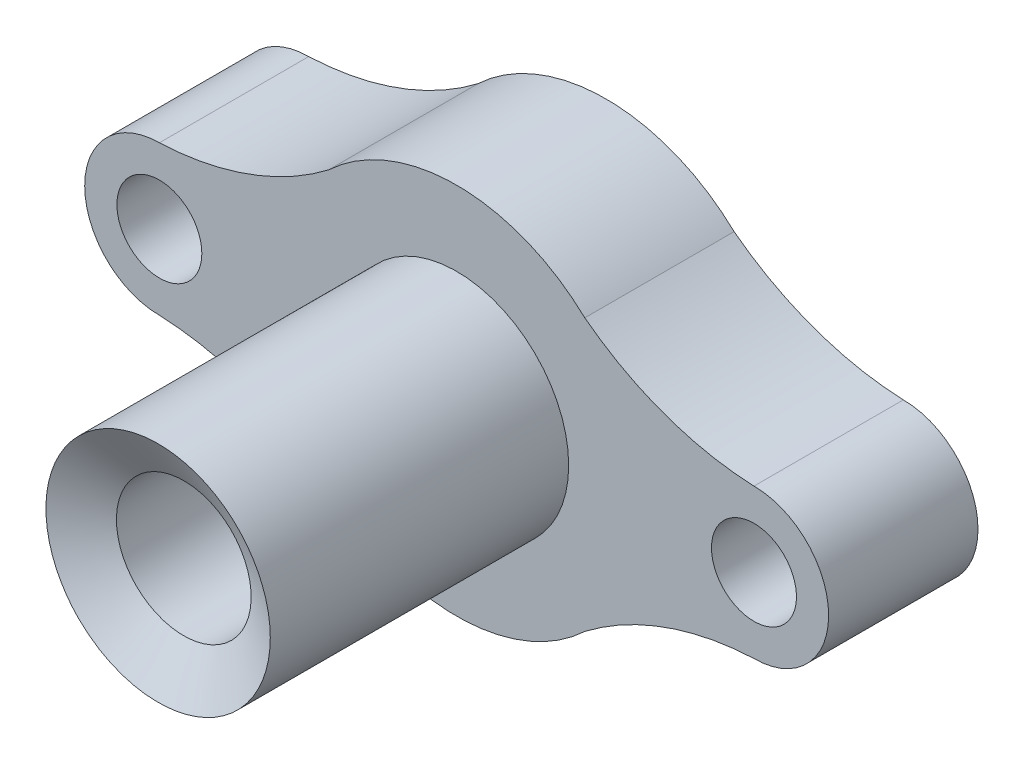
ISO-10303-21;
HEADER;
FILE_DESCRIPTION(('STEP AP214'),'2;1');
FILE_NAME('part.step','',(''),(''),'','','');
FILE_SCHEMA(('AUTOMOTIVE_DESIGN { 1 0 10303 214 1 1 1 1 }'));
ENDSEC;
DATA;
#1=APPLICATION_CONTEXT('core data for automotive mechanical design processes');
#2=APPLICATION_PROTOCOL_DEFINITION('international standard','automotive_design',2000,#1);
#3=PRODUCT_CONTEXT('',#1,'mechanical');
#4=PRODUCT('Part','Part','',(#3));
#5=PRODUCT_RELATED_PRODUCT_CATEGORY('part','',(#4));
#6=PRODUCT_DEFINITION_FORMATION('','',#4);
#7=PRODUCT_DEFINITION_CONTEXT('part definition',#1,'design');
#8=PRODUCT_DEFINITION('design','',#6,#7);
#9=PRODUCT_DEFINITION_SHAPE('','',#8);
#10=(LENGTH_UNIT() NAMED_UNIT(*) SI_UNIT(.MILLI.,.METRE.));
#11=(NAMED_UNIT(*) PLANE_ANGLE_UNIT() SI_UNIT($,.RADIAN.));
#12=(NAMED_UNIT(*) SI_UNIT($,.STERADIAN.) SOLID_ANGLE_UNIT());
#13=UNCERTAINTY_MEASURE_WITH_UNIT(LENGTH_MEASURE(1.E-05),#10,'distance_accuracy_value','');
#14=(GEOMETRIC_REPRESENTATION_CONTEXT(3) GLOBAL_UNCERTAINTY_ASSIGNED_CONTEXT((#13)) GLOBAL_UNIT_ASSIGNED_CONTEXT((#10,
#11,#12)) REPRESENTATION_CONTEXT('',''));
#15=CARTESIAN_POINT('',(0.,0.,0.));
#16=DIRECTION('',(0.,0.,1.));
#17=DIRECTION('',(1.,0.,0.));
#18=AXIS2_PLACEMENT_3D('',#15,#16,#17);
#19=CARTESIAN_POINT('',(0.,0.,300.));
#20=DIRECTION('',(0.,0.,-1.));
#21=DIRECTION('',(-1.,0.,0.));
#22=AXIS2_PLACEMENT_3D('',#19,#20,#21);
#23=CYLINDRICAL_SURFACE('',#22,75.);
#24=CARTESIAN_POINT('',(0.,0.,100.));
#25=DIRECTION('',(0.,0.,1.));
#26=DIRECTION('',(1.,0.,0.));
#27=AXIS2_PLACEMENT_3D('',#24,#25,#26);
#28=CIRCLE('',#27,75.);
#29=CARTESIAN_POINT('',(75.,0.,100.));
#30=VERTEX_POINT('',#29);
#31=EDGE_CURVE('E65',#30,#30,#28,.T.);
#32=ORIENTED_EDGE('',*,*,#31,.T.);
#33=EDGE_LOOP('',(#32));
#34=FACE_BOUND('',#33,.T.);
#35=CARTESIAN_POINT('',(-61.0252990826169,-43.5994595365259,299.980480852214));
#36=CARTESIAN_POINT('',(-60.4128809969187,-44.4566509724594,299.979625264154));
#37=CARTESIAN_POINT('',(-59.7824179628006,-45.3009090738324,299.978744440642));
#38=CARTESIAN_POINT('',(-58.486430905328,-46.9621896569286,299.976933751053));
#39=CARTESIAN_POINT('',(-57.820904437094,-47.7792102329495,299.976003881555));
#40=CARTESIAN_POINT('',(-56.4559004519219,-49.3846300802318,299.974096641425));
#41=CARTESIAN_POINT('',(-55.7564167768266,-50.1730241143996,299.973119262176));
#42=CARTESIAN_POINT('',(-54.324783375334,-51.7197105287908,299.971118788527));
#43=CARTESIAN_POINT('',(-53.5926306318297,-52.4780001164878,299.970095689905));
#44=CARTESIAN_POINT('',(-52.096261393096,-53.9638060674285,299.968004609539));
#45=CARTESIAN_POINT('',(-51.3320130957333,-54.6912904022687,299.966936583275));
#46=CARTESIAN_POINT('',(-49.7734359467015,-56.1134395235662,299.964758409332));
#47=CARTESIAN_POINT('',(-48.979104283293,-56.8081012285531,299.963648257715));
#48=CARTESIAN_POINT('',(-47.3619716584453,-58.1631868672869,299.96138807541));
#49=CARTESIAN_POINT('',(-46.5391752738868,-58.8236162630203,299.960238051133));
#50=CARTESIAN_POINT('',(-44.8663791886079,-60.1092413223152,299.957899883623));
#51=CARTESIAN_POINT('',(-44.0163769500819,-60.7344336838032,299.956711736833));
#52=CARTESIAN_POINT('',(-42.2912272042038,-61.9480730784921,299.954300191895));
#53=CARTESIAN_POINT('',(-41.4160936919506,-62.536540005389,299.953076813365));
#54=CARTESIAN_POINT('',(-39.6417114976382,-63.6761068167788,299.950596236192));
#55=CARTESIAN_POINT('',(-38.7424605676536,-64.2272032010447,299.949339034396));
#56=CARTESIAN_POINT('',(-36.921590695468,-65.2909474438006,299.946793244723));
#57=CARTESIAN_POINT('',(-35.9999734971726,-65.8035982872353,299.945504659292));
#58=CARTESIAN_POINT('',(-34.1358619912945,-66.789631480931,299.942898178746));
#59=CARTESIAN_POINT('',(-33.1933657393382,-67.2630101543059,299.941580280902));
#60=CARTESIAN_POINT('',(-31.2895639230087,-68.1694519159153,299.938918059187));
#61=CARTESIAN_POINT('',(-30.3282650272468,-68.6025289947849,299.937573744685));
#62=CARTESIAN_POINT('',(-28.3882464790829,-69.4277983851737,299.934860624428));
#63=CARTESIAN_POINT('',(-27.4095252064392,-69.8199868706448,299.933491816397));
#64=CARTESIAN_POINT('',(-24.4500114308128,-70.9340413617623,299.929352534709));
#65=CARTESIAN_POINT('',(-22.4453478631323,-71.5936444397238,299.926548474768));
#66=CARTESIAN_POINT('',(-18.387640750951,-72.7416147357459,299.920872112705));
#67=CARTESIAN_POINT('',(-16.3345920438454,-73.2299635922132,299.917999803301));
#68=CARTESIAN_POINT('',(-12.194578404043,-74.0320017401627,299.912207142931));
#69=CARTESIAN_POINT('',(-10.1076134369573,-74.3456908545395,299.909286791918));
#70=CARTESIAN_POINT('',(-5.91461428981311,-74.796148408288,299.903418801123));
#71=CARTESIAN_POINT('',(-3.80857937059909,-74.9329099600932,299.900471160284));
#72=CARTESIAN_POINT('',(0.407529995864249,-75.0285279602957,299.894569615282));
#73=CARTESIAN_POINT('',(2.51760444232348,-74.9873844434855,299.891615711119));
#74=CARTESIAN_POINT('',(6.7267468628134,-74.7274844538542,299.885722705064));
#75=CARTESIAN_POINT('',(8.82581503477657,-74.5087311861985,299.882783602905));
#76=CARTESIAN_POINT('',(12.9980619524689,-73.8951717046809,299.876941055414));
#77=CARTESIAN_POINT('',(15.0712406977096,-73.5003654874969,299.874037610083));
#78=CARTESIAN_POINT('',(19.1769649959032,-72.537507705617,299.868287052562));
#79=CARTESIAN_POINT('',(21.2095106310246,-71.9694564912959,299.865439940259));
#80=CARTESIAN_POINT('',(25.2195229914764,-70.6641469718456,299.859822323445));
#81=CARTESIAN_POINT('',(27.1969897168824,-69.9268886669491,299.857051818935));
#82=CARTESIAN_POINT('',(31.0827891747025,-68.2884048875197,299.851607159598));
#83=CARTESIAN_POINT('',(32.9911217811855,-67.3871791143303,299.848933004947));
#84=CARTESIAN_POINT('',(36.7250820650824,-65.42716845876,299.843700121675));
#85=CARTESIAN_POINT('',(38.5507097425149,-64.3683835764144,299.841141393054));
#86=CARTESIAN_POINT('',(42.1062777756162,-62.1007840673242,299.836157624252));
#87=CARTESIAN_POINT('',(43.8362183041195,-60.8919697115824,299.833732583831));
#88=CARTESIAN_POINT('',(47.1881167361123,-58.3329036600578,299.829033499414));
#89=CARTESIAN_POINT('',(48.8100746397929,-56.9826519645253,299.826759455418));
#90=CARTESIAN_POINT('',(51.9344761877357,-54.1503110957635,299.822378607487));
#91=CARTESIAN_POINT('',(53.4369198668857,-52.6682219610195,299.820271803502));
#92=CARTESIAN_POINT('',(56.3116119860033,-49.5827426121102,299.816240490222));
#93=CARTESIAN_POINT('',(57.6838604258435,-47.9793523978261,299.814315980926));
#94=CARTESIAN_POINT('',(60.2884075327527,-44.6626682661534,299.810663013616));
#95=CARTESIAN_POINT('',(61.5207060524658,-42.9493742330482,299.808934555809));
#96=CARTESIAN_POINT('',(63.8365906844307,-39.4250644892744,299.805686055521));
#97=CARTESIAN_POINT('',(64.9201767967022,-37.6140487786188,299.80416601304));
#98=CARTESIAN_POINT('',(66.9309316184703,-33.9071733144804,299.801345220074));
#99=CARTESIAN_POINT('',(67.8581005277589,-32.0113136693728,299.800044469309));
#100=CARTESIAN_POINT('',(69.549430970552,-28.1482266176067,299.797671566142));
#101=CARTESIAN_POINT('',(70.3135925042738,-26.1809992110433,299.796599413739));
#102=CARTESIAN_POINT('',(71.6734751492866,-22.1891632772435,299.794691382387));
#103=CARTESIAN_POINT('',(72.2691963294702,-20.1645547734763,299.793855503341));
#104=CARTESIAN_POINT('',(73.2879634336667,-16.0723496429975,299.792426002722));
#105=CARTESIAN_POINT('',(73.7110093577776,-14.0047530163101,299.791832381149));
#106=CARTESIAN_POINT('',(74.3814180962679,-9.84127245478861,299.790891646562));
#107=CARTESIAN_POINT('',(74.6287810304055,-7.74538853923818,299.79054453338));
#108=CARTESIAN_POINT('',(74.9460656440345,-3.54023250338786,299.790099300746));
#109=CARTESIAN_POINT('',(75.0159873235867,-1.43096038309257,299.790001181295));
#110=CARTESIAN_POINT('',(74.9778923211456,2.78597666401557,299.790054638833));
#111=CARTESIAN_POINT('',(74.8698756163088,4.89364159062206,299.790206215856));
#112=CARTESIAN_POINT('',(74.4766717410034,9.09237973247542,299.790757980851));
#113=CARTESIAN_POINT('',(74.1914845705386,11.1834529477227,299.791158168823));
#114=CARTESIAN_POINT('',(73.4459674246439,15.3341406152344,299.79220428965));
#115=CARTESIAN_POINT('',(72.9856375136854,17.3937550790788,299.792850222416));
#116=CARTESIAN_POINT('',(71.8931075663781,21.4668834131797,299.794383207629));
#117=CARTESIAN_POINT('',(71.2609075300985,23.4803972834547,299.795270260076));
#118=CARTESIAN_POINT('',(69.8291319499831,27.4470094786123,299.797279133877));
#119=CARTESIAN_POINT('',(69.0295564136628,29.4001078062077,299.79840095522));
#120=CARTESIAN_POINT('',(67.2687143431536,33.2320036758553,299.800871337016));
#121=CARTESIAN_POINT('',(66.3074478089104,35.1108012178826,299.802219897469));
#122=CARTESIAN_POINT('',(64.2300574708533,38.7807389970544,299.805134107666));
#123=CARTESIAN_POINT('',(63.1139336187105,40.571879206842,299.806699757479));
#124=CARTESIAN_POINT('',(60.7347638700989,44.0537677940844,299.810036945752));
#125=CARTESIAN_POINT('',(59.4717179736131,45.7445161715276,299.811808484211));
#126=CARTESIAN_POINT('',(56.8076835926576,49.0136010078991,299.815544781115));
#127=CARTESIAN_POINT('',(55.4066951016,50.5919374614589,299.817509539569));
#128=CARTESIAN_POINT('',(52.4767357843378,53.6249773857918,299.821618231393));
#129=CARTESIAN_POINT('',(50.9477649580437,55.0796808564786,299.823762164765));
#130=CARTESIAN_POINT('',(47.7727096837939,57.8551139876717,299.828213889138));
#131=CARTESIAN_POINT('',(46.1266251357751,59.175843533707,299.830521680279));
#132=CARTESIAN_POINT('',(42.7290462633567,61.6739378488405,299.835284636247));
#133=CARTESIAN_POINT('',(40.9775519389121,62.8513026178777,299.837739801073));
#134=CARTESIAN_POINT('',(37.3816058194569,65.0542969288155,299.842779978001));
#135=CARTESIAN_POINT('',(35.5371540362321,66.0799264899542,299.845364990087));
#136=CARTESIAN_POINT('',(31.7684057290993,67.9721590017509,299.850646418603));
#137=CARTESIAN_POINT('',(29.8441092051631,68.8387619523524,299.853342835033));
#138=CARTESIAN_POINT('',(25.9293503894084,70.4067809021774,299.858827847091));
#139=CARTESIAN_POINT('',(23.9388880436095,71.1081967666318,299.861616442796));
#140=CARTESIAN_POINT('',(19.9059500571794,72.34085402115,299.867265938042));
#141=CARTESIAN_POINT('',(17.8634744165093,72.8720954110867,299.870126837584));
#142=CARTESIAN_POINT('',(13.741029755975,73.7606271170428,299.875900565211));
#143=CARTESIAN_POINT('',(11.6610607207904,74.1179173619809,299.878813393317));
#144=CARTESIAN_POINT('',(7.4784174021407,74.6560063517595,299.88467024314));
#145=CARTESIAN_POINT('',(5.37574311865159,74.8368050964135,299.887614264858));
#146=CARTESIAN_POINT('',(1.16263592943693,75.0206258151817,299.893512561882));
#147=CARTESIAN_POINT('',(-0.947796984056895,75.0236476112495,299.896466837199));
#148=CARTESIAN_POINT('',(-5.16141541257562,74.8518925008476,299.902364635498));
#149=CARTESIAN_POINT('',(-7.26460092760044,74.677115594376,299.905308158481));
#150=CARTESIAN_POINT('',(-11.448769948724,74.1510059097441,299.911163535385));
#151=CARTESIAN_POINT('',(-13.5297534782449,73.7996733178611,299.914075389341));
#152=CARTESIAN_POINT('',(-17.6547262517617,72.9229501045983,299.919846755424));
#153=CARTESIAN_POINT('',(-19.6987154958101,72.3975594834657,299.922706267552));
#154=CARTESIAN_POINT('',(-23.7351676241128,71.1764555649576,299.928352657196));
#155=CARTESIAN_POINT('',(-25.7276305223226,70.480742313713,299.931139534731));
#156=CARTESIAN_POINT('',(-29.6468653275792,68.9239391333934,299.93662089108));
#157=CARTESIAN_POINT('',(-31.5736372345342,68.062849204087,299.939315369894));
#158=CARTESIAN_POINT('',(-35.3477952664669,66.1814127664493,299.944592834873));
#159=CARTESIAN_POINT('',(-37.19518124828,65.1610659709294,299.947175820838));
#160=CARTESIAN_POINT('',(-40.7974298705565,62.9683709702589,299.952211996547));
#161=CARTESIAN_POINT('',(-42.5522925110374,61.796022765137,299.95466518629));
#162=CARTESIAN_POINT('',(-45.9570142352387,59.3076626424246,299.959424394003));
#163=CARTESIAN_POINT('',(-47.6068735733906,57.9916510729629,299.961730412328));
#164=CARTESIAN_POINT('',(-50.7898637994509,55.2253179483815,299.966178964117));
#165=CARTESIAN_POINT('',(-52.3229946872518,53.7749963931378,299.96832149758));
#166=CARTESIAN_POINT('',(-55.2616313316368,50.7503509843089,299.972427928245));
#167=CARTESIAN_POINT('',(-56.6671368304371,49.1760268802693,299.974391825086));
#168=CARTESIAN_POINT('',(-59.3405267355261,45.914571992418,299.978127091419));
#169=CARTESIAN_POINT('',(-60.6084111444402,44.2274412107582,299.979898460914));
#170=CARTESIAN_POINT('',(-62.9975663026102,40.7523348501355,299.983236182545));
#171=CARTESIAN_POINT('',(-64.1188344611142,38.9643574899829,299.984802531058));
#172=CARTESIAN_POINT('',(-66.2067581849038,35.300303698662,299.987719105562));
#173=CARTESIAN_POINT('',(-67.1734137200033,33.4242272502936,299.98906933151));
#174=CARTESIAN_POINT('',(-68.9452082261913,29.5973623797414,299.991544079711));
#175=CARTESIAN_POINT('',(-69.7503534830495,27.6465768686575,299.992668610747));
#176=CARTESIAN_POINT('',(-71.1934369656954,23.6841929866528,299.994684075276));
#177=CARTESIAN_POINT('',(-71.8313753610201,21.6725946773946,299.995575009006));
#178=CARTESIAN_POINT('',(-72.9355000287952,17.6027384246621,299.997116975456));
#179=CARTESIAN_POINT('',(-73.4017046994118,15.5444855044806,299.997768033875));
#180=CARTESIAN_POINT('',(-73.9697010235222,12.4336627363362,299.998561233695));
#181=CARTESIAN_POINT('',(-74.137161901397,11.3926709697162,299.998795088387));
#182=CARTESIAN_POINT('',(-74.428055369163,9.30458047686063,299.999201310966));
#183=CARTESIAN_POINT('',(-74.5514920733641,8.25748233060174,299.999373684599));
#184=CARTESIAN_POINT('',(-74.7541496412125,6.15866668498287,299.99965668541));
#185=CARTESIAN_POINT('',(-74.8333550774141,5.10694770266686,299.999767291044));
#186=CARTESIAN_POINT('',(-74.9473444822352,3.0011987835006,299.999926470131));
#187=CARTESIAN_POINT('',(-74.9821326040937,1.94716907194858,299.999975049383));
#188=CARTESIAN_POINT('',(-75.0072383115242,-0.161500472687234,300.000010107816));
#189=CARTESIAN_POINT('',(-74.9975524403086,-1.2161403468262,299.999996582171));
#190=CARTESIAN_POINT('',(-74.9337229782159,-3.323975443013,299.999907448531));
#191=CARTESIAN_POINT('',(-74.8795835453397,-4.37717079094729,299.999831846342));
#192=CARTESIAN_POINT('',(-74.7269067237896,-6.48091696362107,299.999618642094));
#193=CARTESIAN_POINT('',(-74.6283450953917,-7.5314660292286,299.999481006184));
#194=CARTESIAN_POINT('',(-74.3870039101058,-9.62737311505958,299.999143984112));
#195=CARTESIAN_POINT('',(-74.2442284905076,-10.6727316116933,299.998944603727));
#196=CARTESIAN_POINT('',(-73.9146844435207,-12.7566627090199,299.998484403954));
#197=CARTESIAN_POINT('',(-73.7279087775501,-13.7952341966698,299.998223574736));
#198=CARTESIAN_POINT('',(-73.3107286911304,-15.8634760140516,299.997640982917));
#199=CARTESIAN_POINT('',(-73.0803283598054,-16.893147168598,299.997319226027));
#200=CARTESIAN_POINT('',(-72.576553270867,-18.9408148615637,299.99661568857));
#201=CARTESIAN_POINT('',(-72.3032223412983,-19.9588221826675,299.996233969219));
#202=CARTESIAN_POINT('',(-71.7139316376388,-21.9823194304883,299.995410984705));
#203=CARTESIAN_POINT('',(-71.3979758106285,-22.9878105068084,299.994969725055));
#204=CARTESIAN_POINT('',(-70.724035777553,-24.9844087682724,299.994028493096));
#205=CARTESIAN_POINT('',(-70.3660592310634,-25.9755185379603,299.993528531487));
#206=CARTESIAN_POINT('',(-69.6087041174473,-27.9416923090671,299.992470764315));
#207=CARTESIAN_POINT('',(-69.2093284425336,-28.9167574258851,299.991912962794));
#208=CARTESIAN_POINT('',(-68.2652269195673,-31.0900376701298,299.990594323302));
#209=CARTESIAN_POINT('',(-67.7090807807676,-32.2833121214266,299.989817527766));
#210=CARTESIAN_POINT('',(-66.5349122149982,-34.6386599400044,299.988177461826));
#211=CARTESIAN_POINT('',(-65.9169035213326,-35.8007401599883,299.987314210616));
#212=CARTESIAN_POINT('',(-64.6206119810077,-38.0907819956437,299.985503455848));
#213=CARTESIAN_POINT('',(-63.9423291344141,-39.2187436113522,299.98455595229));
#214=CARTESIAN_POINT('',(-62.5271920646998,-41.4376895338412,299.982579055035));
#215=CARTESIAN_POINT('',(-61.790324898039,-42.5286655927118,299.98154964324));
#216=CARTESIAN_POINT('',(-61.0252990826169,-43.5994595365259,299.980480852214));
#217=B_SPLINE_CURVE_WITH_KNOTS('',3,(#35,#36,#37,#38,#39,#40,#41,#42,#43,#44,#45,#46,#47,#48,
#49,#50,#51,#52,#53,#54,#55,#56,#57,#58,#59,#60,#61,#62,#63,#64,#65,#66,#67,#68,#69,#70,#71,#72,
#73,#74,#75,#76,#77,#78,#79,#80,#81,#82,#83,#84,#85,#86,#87,#88,#89,#90,#91,#92,#93,#94,#95,#96,
#97,#98,#99,#100,#101,#102,#103,#104,#105,#106,#107,#108,#109,#110,#111,#112,#113,#114,#115,
#116,#117,#118,#119,#120,#121,#122,#123,#124,#125,#126,#127,#128,#129,#130,#131,#132,#133,#134,
#135,#136,#137,#138,#139,#140,#141,#142,#143,#144,#145,#146,#147,#148,#149,#150,#151,#152,#153,
#154,#155,#156,#157,#158,#159,#160,#161,#162,#163,#164,#165,#166,#167,#168,#169,#170,#171,#172,
#173,#174,#175,#176,#177,#178,#179,#180,#181,#182,#183,#184,#185,#186,#187,#188,#189,#190,#191,
#192,#193,#194,#195,#196,#197,#198,#199,#200,#201,#202,#203,#204,#205,#206,#207,#208,#209,#210,
#211,#212,#213,#214,#215,#216),.UNSPECIFIED.,.T.,.F.,(4,2,2,2,2,2,2,2,2,2,2,2,2,2,2,2,2,2,2,2,2,
2,2,2,2,2,2,2,2,2,2,2,2,2,2,2,2,2,2,2,2,2,2,2,2,2,2,2,2,2,2,2,2,2,2,2,2,2,2,2,2,2,2,2,2,2,2,2,2,
2,2,2,2,2,2,2,2,2,2,2,2,2,2,2,2,2,2,2,2,2,4),(0.,3.16016778488458,6.3205562121999,
9.48151993438466,12.6427761897046,15.8072423304919,18.9720049713368,22.136261089521,
25.300813239794,28.4636360416971,31.6267546741904,34.789627464636,37.9527960479883,
41.1148624137142,44.2772243968601,50.6002224888128,56.9238983149957,63.2475805533916,
69.5715089573415,75.8954361245341,82.2192491719683,88.5430623387322,94.8668627161543,
101.190663084881,107.514474972134,113.838286857969,120.16208732108,126.485887773003,
132.809686378926,139.133484991039,145.457290261535,151.781095531192,158.104892723382,
164.428689907147,170.752484504459,177.076279098185,183.400069381149,189.723859661947,
196.047650754584,202.371441847081,208.69523061174,215.019019373855,221.34280785202,
227.666596332304,233.990386786157,240.314177240737,246.637967997326,252.961758758337,
259.285554922527,265.609351089411,271.933146454523,278.256941821883,284.580742348543,
290.904542879928,297.228345995388,303.55214911753,309.875958573063,316.199768028659,
322.523570812249,328.847373586856,335.171174648696,341.494975719386,347.818788193945,
354.142600667309,360.466397816981,366.790194972482,373.114004900806,379.437814708494,
385.761736244648,392.085659015462,398.409335619668,404.733005812046,411.055998340237,
414.218357543507,417.380421128811,420.543586924078,423.706456926014,426.869572769485,
430.032392781979,433.196940734232,436.36119265447,439.525951094323,442.690413034727,
445.851665112268,449.01262465744,452.173008912108,455.333172525622,459.280818742199,
463.227590528413,467.174362310325,471.122008522872),.UNSPECIFIED.);
#218=CARTESIAN_POINT('',(-61.0252990826169,-43.5994595365259,299.980480852214));
#219=VERTEX_POINT('',#218);
#220=EDGE_CURVE('E407',#219,#219,#217,.T.);
#221=ORIENTED_EDGE('',*,*,#220,.F.);
#222=EDGE_LOOP('',(#221));
#223=FACE_BOUND('',#222,.T.);
#224=ADVANCED_FACE('F49',(#34,#223),#23,.T.);
#225=CARTESIAN_POINT('',(-103.608694218909,124.9166836514,100.));
#226=DIRECTION('',(0.,0.,1.));
#227=DIRECTION('',(1.,0.,0.));
#228=AXIS2_PLACEMENT_3D('',#225,#226,#227);
#229=PLANE('',#228);
#230=ORIENTED_EDGE('',*,*,#31,.F.);
#231=EDGE_LOOP('',(#230));
#232=FACE_BOUND('',#231,.T.);
#233=CARTESIAN_POINT('',(-199.054955441204,0.,100.));
#234=DIRECTION('',(0.,0.,1.));
#235=DIRECTION('',(1.,0.,0.));
#236=AXIS2_PLACEMENT_3D('',#233,#234,#235);
#237=CIRCLE('',#236,28.4398303063576);
#238=CARTESIAN_POINT('',(-170.615125134846,0.,100.));
#239=VERTEX_POINT('',#238);
#240=EDGE_CURVE('E165',#239,#239,#237,.T.);
#241=ORIENTED_EDGE('',*,*,#240,.F.);
#242=EDGE_LOOP('',(#241));
#243=FACE_BOUND('',#242,.T.);
#244=CARTESIAN_POINT('',(-207.217388437819,249.8333673028,100.));
#245=DIRECTION('',(0.,0.,-1.));
#246=DIRECTION('',(1.,0.,0.));
#247=AXIS2_PLACEMENT_3D('',#244,#245,#246);
#248=CIRCLE('',#247,200.);
#249=CARTESIAN_POINT('',(-85.7818553532837,90.9201478889488,100.));
#250=VERTEX_POINT('',#249);
#251=CARTESIAN_POINT('',(-199.054955441204,50.,100.));
#252=VERTEX_POINT('',#251);
#253=EDGE_CURVE('E183',#250,#252,#248,.T.);
#254=ORIENTED_EDGE('',*,*,#253,.T.);
#255=CARTESIAN_POINT('',(-199.054955441204,0.,100.));
#256=DIRECTION('',(0.,0.,1.));
#257=DIRECTION('',(1.,0.,0.));
#258=AXIS2_PLACEMENT_3D('',#255,#256,#257);
#259=CIRCLE('',#258,50.);
#260=CARTESIAN_POINT('',(-199.054955441204,-50.,100.));
#261=VERTEX_POINT('',#260);
#262=EDGE_CURVE('E118',#252,#261,#259,.T.);
#263=ORIENTED_EDGE('',*,*,#262,.T.);
#264=CARTESIAN_POINT('',(-207.217388437819,-249.8333673028,100.));
#265=DIRECTION('',(0.,0.,-1.));
#266=DIRECTION('',(-1.,0.,0.));
#267=AXIS2_PLACEMENT_3D('',#264,#265,#266);
#268=CIRCLE('',#267,200.);
#269=CARTESIAN_POINT('',(-85.7818553532837,-90.9201478889488,100.));
#270=VERTEX_POINT('',#269);
#271=EDGE_CURVE('E232',#261,#270,#268,.T.);
#272=ORIENTED_EDGE('',*,*,#271,.T.);
#273=CARTESIAN_POINT('',(0.,0.,100.));
#274=DIRECTION('',(0.,0.,1.));
#275=DIRECTION('',(1.,0.,0.));
#276=AXIS2_PLACEMENT_3D('',#273,#274,#275);
#277=CIRCLE('',#276,125.);
#278=CARTESIAN_POINT('',(85.7818553532838,-90.9201478889487,100.));
#279=VERTEX_POINT('',#278);
#280=EDGE_CURVE('E235',#270,#279,#277,.T.);
#281=ORIENTED_EDGE('',*,*,#280,.T.);
#282=CARTESIAN_POINT('',(207.217388437819,-249.8333673028,100.));
#283=DIRECTION('',(0.,0.,-1.));
#284=DIRECTION('',(1.,0.,0.));
#285=AXIS2_PLACEMENT_3D('',#282,#283,#284);
#286=CIRCLE('',#285,200.);
#287=CARTESIAN_POINT('',(199.054955441204,-49.9999999999999,100.));
#288=VERTEX_POINT('',#287);
#289=EDGE_CURVE('E138',#279,#288,#286,.T.);
#290=ORIENTED_EDGE('',*,*,#289,.T.);
#291=CARTESIAN_POINT('',(199.054955441204,1.11022302462516E-13,100.));
#292=DIRECTION('',(0.,0.,1.));
#293=DIRECTION('',(-1.,0.,0.));
#294=AXIS2_PLACEMENT_3D('',#291,#292,#293);
#295=CIRCLE('',#294,50.);
#296=CARTESIAN_POINT('',(199.054955441204,50.0000000000001,100.));
#297=VERTEX_POINT('',#296);
#298=EDGE_CURVE('E131',#288,#297,#295,.T.);
#299=ORIENTED_EDGE('',*,*,#298,.T.);
#300=CARTESIAN_POINT('',(207.217388437819,249.8333673028,100.));
#301=DIRECTION('',(0.,0.,-1.));
#302=DIRECTION('',(-1.,0.,0.));
#303=AXIS2_PLACEMENT_3D('',#300,#301,#302);
#304=CIRCLE('',#303,200.);
#305=CARTESIAN_POINT('',(85.7818553532837,90.9201478889488,100.));
#306=VERTEX_POINT('',#305);
#307=EDGE_CURVE('E136',#297,#306,#304,.T.);
#308=ORIENTED_EDGE('',*,*,#307,.T.);
#309=CARTESIAN_POINT('',(0.,0.,100.));
#310=DIRECTION('',(0.,0.,1.));
#311=DIRECTION('',(1.,0.,0.));
#312=AXIS2_PLACEMENT_3D('',#309,#310,#311);
#313=CIRCLE('',#312,125.);
#314=EDGE_CURVE('E74',#306,#250,#313,.T.);
#315=ORIENTED_EDGE('',*,*,#314,.T.);
#316=EDGE_LOOP('',(#254,#263,#272,#281,#290,#299,#308,#315));
#317=FACE_BOUND('',#316,.T.);
#318=CARTESIAN_POINT('',(199.054955441204,1.11022302462516E-13,100.));
#319=DIRECTION('',(0.,0.,1.));
#320=DIRECTION('',(-1.,0.,0.));
#321=AXIS2_PLACEMENT_3D('',#318,#319,#320);
#322=CIRCLE('',#321,28.4398303063576);
#323=CARTESIAN_POINT('',(170.615125134846,1.11022302462516E-13,100.));
#324=VERTEX_POINT('',#323);
#325=EDGE_CURVE('E222',#324,#324,#322,.T.);
#326=ORIENTED_EDGE('',*,*,#325,.F.);
#327=EDGE_LOOP('',(#326));
#328=FACE_BOUND('',#327,.T.);
#329=ADVANCED_FACE('F133',(#232,#243,#317,#328),#229,.T.);
#330=CARTESIAN_POINT('',(-103.608694218909,124.9166836514,0.));
#331=DIRECTION('',(0.,0.,1.));
#332=DIRECTION('',(1.,0.,0.));
#333=AXIS2_PLACEMENT_3D('',#330,#331,#332);
#334=PLANE('',#333);
#335=CARTESIAN_POINT('',(-207.217388437819,249.8333673028,0.));
#336=DIRECTION('',(0.,0.,-1.));
#337=DIRECTION('',(1.,0.,0.));
#338=AXIS2_PLACEMENT_3D('',#335,#336,#337);
#339=CIRCLE('',#338,200.);
#340=CARTESIAN_POINT('',(-85.7818553532837,90.9201478889488,0.));
#341=VERTEX_POINT('',#340);
#342=CARTESIAN_POINT('',(-199.054955441204,50.,0.));
#343=VERTEX_POINT('',#342);
#344=EDGE_CURVE('E160',#341,#343,#339,.T.);
#345=ORIENTED_EDGE('',*,*,#344,.F.);
#346=CARTESIAN_POINT('',(0.,0.,0.));
#347=DIRECTION('',(0.,0.,1.));
#348=DIRECTION('',(1.,0.,0.));
#349=AXIS2_PLACEMENT_3D('',#346,#347,#348);
#350=CIRCLE('',#349,125.);
#351=CARTESIAN_POINT('',(85.7818553532837,90.9201478889488,0.));
#352=VERTEX_POINT('',#351);
#353=EDGE_CURVE('E109',#352,#341,#350,.T.);
#354=ORIENTED_EDGE('',*,*,#353,.F.);
#355=CARTESIAN_POINT('',(207.217388437819,249.8333673028,0.));
#356=DIRECTION('',(0.,0.,-1.));
#357=DIRECTION('',(-1.,0.,0.));
#358=AXIS2_PLACEMENT_3D('',#355,#356,#357);
#359=CIRCLE('',#358,200.);
#360=CARTESIAN_POINT('',(199.054955441204,50.0000000000001,0.));
#361=VERTEX_POINT('',#360);
#362=EDGE_CURVE('E103',#361,#352,#359,.T.);
#363=ORIENTED_EDGE('',*,*,#362,.F.);
#364=CARTESIAN_POINT('',(199.054955441204,1.11022302462516E-13,0.));
#365=DIRECTION('',(0.,0.,1.));
#366=DIRECTION('',(-1.,0.,0.));
#367=AXIS2_PLACEMENT_3D('',#364,#365,#366);
#368=CIRCLE('',#367,50.);
#369=CARTESIAN_POINT('',(199.054955441204,-49.9999999999999,0.));
#370=VERTEX_POINT('',#369);
#371=EDGE_CURVE('E147',#370,#361,#368,.T.);
#372=ORIENTED_EDGE('',*,*,#371,.F.);
#373=CARTESIAN_POINT('',(207.217388437819,-249.8333673028,0.));
#374=DIRECTION('',(0.,0.,-1.));
#375=DIRECTION('',(1.,0.,0.));
#376=AXIS2_PLACEMENT_3D('',#373,#374,#375);
#377=CIRCLE('',#376,200.);
#378=CARTESIAN_POINT('',(85.7818553532838,-90.9201478889487,0.));
#379=VERTEX_POINT('',#378);
#380=EDGE_CURVE('E174',#379,#370,#377,.T.);
#381=ORIENTED_EDGE('',*,*,#380,.F.);
#382=CARTESIAN_POINT('',(0.,0.,0.));
#383=DIRECTION('',(0.,0.,1.));
#384=DIRECTION('',(1.,0.,0.));
#385=AXIS2_PLACEMENT_3D('',#382,#383,#384);
#386=CIRCLE('',#385,125.);
#387=CARTESIAN_POINT('',(-85.7818553532837,-90.9201478889488,0.));
#388=VERTEX_POINT('',#387);
#389=EDGE_CURVE('E171',#388,#379,#386,.T.);
#390=ORIENTED_EDGE('',*,*,#389,.F.);
#391=CARTESIAN_POINT('',(-207.217388437819,-249.8333673028,0.));
#392=DIRECTION('',(0.,0.,-1.));
#393=DIRECTION('',(-1.,0.,0.));
#394=AXIS2_PLACEMENT_3D('',#391,#392,#393);
#395=CIRCLE('',#394,200.);
#396=CARTESIAN_POINT('',(-199.054955441204,-50.,0.));
#397=VERTEX_POINT('',#396);
#398=EDGE_CURVE('E168',#397,#388,#395,.T.);
#399=ORIENTED_EDGE('',*,*,#398,.F.);
#400=CARTESIAN_POINT('',(-199.054955441204,0.,0.));
#401=DIRECTION('',(0.,0.,1.));
#402=DIRECTION('',(1.,0.,0.));
#403=AXIS2_PLACEMENT_3D('',#400,#401,#402);
#404=CIRCLE('',#403,50.);
#405=EDGE_CURVE('E164',#343,#397,#404,.T.);
#406=ORIENTED_EDGE('',*,*,#405,.F.);
#407=EDGE_LOOP('',(#345,#354,#363,#372,#381,#390,#399,#406));
#408=FACE_BOUND('',#407,.T.);
#409=CARTESIAN_POINT('',(-199.054955441204,0.,0.));
#410=DIRECTION('',(0.,0.,1.));
#411=DIRECTION('',(1.,0.,0.));
#412=AXIS2_PLACEMENT_3D('',#409,#410,#411);
#413=CIRCLE('',#412,28.4398303063576);
#414=CARTESIAN_POINT('',(-170.615125134846,0.,0.));
#415=VERTEX_POINT('',#414);
#416=EDGE_CURVE('E218',#415,#415,#413,.T.);
#417=ORIENTED_EDGE('',*,*,#416,.T.);
#418=EDGE_LOOP('',(#417));
#419=FACE_BOUND('',#418,.T.);
#420=CARTESIAN_POINT('',(199.054955441204,1.11022302462516E-13,0.));
#421=DIRECTION('',(0.,0.,1.));
#422=DIRECTION('',(-1.,0.,0.));
#423=AXIS2_PLACEMENT_3D('',#420,#421,#422);
#424=CIRCLE('',#423,28.4398303063576);
#425=CARTESIAN_POINT('',(170.615125134846,1.11022302462516E-13,0.));
#426=VERTEX_POINT('',#425);
#427=EDGE_CURVE('E225',#426,#426,#424,.T.);
#428=ORIENTED_EDGE('',*,*,#427,.T.);
#429=EDGE_LOOP('',(#428));
#430=FACE_BOUND('',#429,.T.);
#431=ADVANCED_FACE('F212',(#408,#419,#430),#334,.F.);
#432=CARTESIAN_POINT('',(-207.217388437819,249.8333673028,100.));
#433=DIRECTION('',(0.,0.,-1.));
#434=DIRECTION('',(-1.,0.,0.));
#435=AXIS2_PLACEMENT_3D('',#432,#433,#434);
#436=CYLINDRICAL_SURFACE('',#435,200.);
#437=ORIENTED_EDGE('',*,*,#344,.T.);
#438=DIRECTION('',(0.,0.,-1.));
#439=VECTOR('',#438,1.);
#440=CARTESIAN_POINT('',(-199.054955441204,50.,100.));
#441=LINE('',#440,#439);
#442=EDGE_CURVE('E202',#252,#343,#441,.T.);
#443=ORIENTED_EDGE('',*,*,#442,.F.);
#444=ORIENTED_EDGE('',*,*,#253,.F.);
#445=DIRECTION('',(0.,0.,-1.));
#446=VECTOR('',#445,1.);
#447=CARTESIAN_POINT('',(-85.7818553532837,90.9201478889488,100.));
#448=LINE('',#447,#446);
#449=EDGE_CURVE('E156',#250,#341,#448,.T.);
#450=ORIENTED_EDGE('',*,*,#449,.T.);
#451=EDGE_LOOP('',(#437,#443,#444,#450));
#452=FACE_BOUND('',#451,.T.);
#453=ADVANCED_FACE('F254',(#452),#436,.F.);
#454=CARTESIAN_POINT('',(-199.054955441204,0.,100.));
#455=DIRECTION('',(0.,0.,-1.));
#456=DIRECTION('',(-1.,0.,0.));
#457=AXIS2_PLACEMENT_3D('',#454,#455,#456);
#458=CYLINDRICAL_SURFACE('',#457,50.);
#459=ORIENTED_EDGE('',*,*,#405,.T.);
#460=DIRECTION('',(0.,0.,-1.));
#461=VECTOR('',#460,1.);
#462=CARTESIAN_POINT('',(-199.054955441204,-50.,100.));
#463=LINE('',#462,#461);
#464=EDGE_CURVE('E198',#261,#397,#463,.T.);
#465=ORIENTED_EDGE('',*,*,#464,.F.);
#466=ORIENTED_EDGE('',*,*,#262,.F.);
#467=ORIENTED_EDGE('',*,*,#442,.T.);
#468=EDGE_LOOP('',(#459,#465,#466,#467));
#469=FACE_BOUND('',#468,.T.);
#470=ADVANCED_FACE('F349',(#469),#458,.T.);
#471=CARTESIAN_POINT('',(-207.217388437819,-249.8333673028,100.));
#472=DIRECTION('',(0.,0.,-1.));
#473=DIRECTION('',(-1.,0.,0.));
#474=AXIS2_PLACEMENT_3D('',#471,#472,#473);
#475=CYLINDRICAL_SURFACE('',#474,200.);
#476=ORIENTED_EDGE('',*,*,#398,.T.);
#477=DIRECTION('',(0.,0.,-1.));
#478=VECTOR('',#477,1.);
#479=CARTESIAN_POINT('',(-85.7818553532837,-90.9201478889488,100.));
#480=LINE('',#479,#478);
#481=EDGE_CURVE('E194',#270,#388,#480,.T.);
#482=ORIENTED_EDGE('',*,*,#481,.F.);
#483=ORIENTED_EDGE('',*,*,#271,.F.);
#484=ORIENTED_EDGE('',*,*,#464,.T.);
#485=EDGE_LOOP('',(#476,#482,#483,#484));
#486=FACE_BOUND('',#485,.T.);
#487=ADVANCED_FACE('F340',(#486),#475,.F.);
#488=CARTESIAN_POINT('',(0.,0.,100.));
#489=DIRECTION('',(0.,0.,-1.));
#490=DIRECTION('',(-1.,0.,0.));
#491=AXIS2_PLACEMENT_3D('',#488,#489,#490);
#492=CYLINDRICAL_SURFACE('',#491,125.);
#493=ORIENTED_EDGE('',*,*,#389,.T.);
#494=DIRECTION('',(0.,0.,-1.));
#495=VECTOR('',#494,1.);
#496=CARTESIAN_POINT('',(85.7818553532838,-90.9201478889487,100.));
#497=LINE('',#496,#495);
#498=EDGE_CURVE('E190',#279,#379,#497,.T.);
#499=ORIENTED_EDGE('',*,*,#498,.F.);
#500=ORIENTED_EDGE('',*,*,#280,.F.);
#501=ORIENTED_EDGE('',*,*,#481,.T.);
#502=EDGE_LOOP('',(#493,#499,#500,#501));
#503=FACE_BOUND('',#502,.T.);
#504=ADVANCED_FACE('F243',(#503),#492,.T.);
#505=CARTESIAN_POINT('',(207.217388437819,-249.8333673028,100.));
#506=DIRECTION('',(0.,0.,-1.));
#507=DIRECTION('',(-1.,0.,0.));
#508=AXIS2_PLACEMENT_3D('',#505,#506,#507);
#509=CYLINDRICAL_SURFACE('',#508,200.);
#510=ORIENTED_EDGE('',*,*,#380,.T.);
#511=DIRECTION('',(0.,0.,-1.));
#512=VECTOR('',#511,1.);
#513=CARTESIAN_POINT('',(199.054955441204,-49.9999999999999,100.));
#514=LINE('',#513,#512);
#515=EDGE_CURVE('E149',#288,#370,#514,.T.);
#516=ORIENTED_EDGE('',*,*,#515,.F.);
#517=ORIENTED_EDGE('',*,*,#289,.F.);
#518=ORIENTED_EDGE('',*,*,#498,.T.);
#519=EDGE_LOOP('',(#510,#516,#517,#518));
#520=FACE_BOUND('',#519,.T.);
#521=ADVANCED_FACE('F247',(#520),#509,.F.);
#522=CARTESIAN_POINT('',(199.054955441204,1.11022302462516E-13,100.));
#523=DIRECTION('',(0.,0.,-1.));
#524=DIRECTION('',(-1.,0.,0.));
#525=AXIS2_PLACEMENT_3D('',#522,#523,#524);
#526=CYLINDRICAL_SURFACE('',#525,50.);
#527=ORIENTED_EDGE('',*,*,#371,.T.);
#528=DIRECTION('',(0.,0.,-1.));
#529=VECTOR('',#528,1.);
#530=CARTESIAN_POINT('',(199.054955441204,50.0000000000001,100.));
#531=LINE('',#530,#529);
#532=EDGE_CURVE('E144',#297,#361,#531,.T.);
#533=ORIENTED_EDGE('',*,*,#532,.F.);
#534=ORIENTED_EDGE('',*,*,#298,.F.);
#535=ORIENTED_EDGE('',*,*,#515,.T.);
#536=EDGE_LOOP('',(#527,#533,#534,#535));
#537=FACE_BOUND('',#536,.T.);
#538=ADVANCED_FACE('F145',(#537),#526,.T.);
#539=CARTESIAN_POINT('',(207.217388437819,249.8333673028,100.));
#540=DIRECTION('',(0.,0.,-1.));
#541=DIRECTION('',(-1.,0.,0.));
#542=AXIS2_PLACEMENT_3D('',#539,#540,#541);
#543=CYLINDRICAL_SURFACE('',#542,200.);
#544=ORIENTED_EDGE('',*,*,#362,.T.);
#545=DIRECTION('',(0.,0.,-1.));
#546=VECTOR('',#545,1.);
#547=CARTESIAN_POINT('',(85.7818553532837,90.9201478889488,100.));
#548=LINE('',#547,#546);
#549=EDGE_CURVE('E150',#306,#352,#548,.T.);
#550=ORIENTED_EDGE('',*,*,#549,.F.);
#551=ORIENTED_EDGE('',*,*,#307,.F.);
#552=ORIENTED_EDGE('',*,*,#532,.T.);
#553=EDGE_LOOP('',(#544,#550,#551,#552));
#554=FACE_BOUND('',#553,.T.);
#555=ADVANCED_FACE('F152',(#554),#543,.F.);
#556=CARTESIAN_POINT('',(0.,0.,100.));
#557=DIRECTION('',(0.,0.,-1.));
#558=DIRECTION('',(-1.,0.,0.));
#559=AXIS2_PLACEMENT_3D('',#556,#557,#558);
#560=CYLINDRICAL_SURFACE('',#559,125.);
#561=ORIENTED_EDGE('',*,*,#353,.T.);
#562=ORIENTED_EDGE('',*,*,#449,.F.);
#563=ORIENTED_EDGE('',*,*,#314,.F.);
#564=ORIENTED_EDGE('',*,*,#549,.T.);
#565=EDGE_LOOP('',(#561,#562,#563,#564));
#566=FACE_BOUND('',#565,.T.);
#567=ADVANCED_FACE('F256',(#566),#560,.T.);
#568=CARTESIAN_POINT('',(-199.054955441204,0.,100.));
#569=DIRECTION('',(0.,0.,-1.));
#570=DIRECTION('',(-1.,0.,0.));
#571=AXIS2_PLACEMENT_3D('',#568,#569,#570);
#572=CYLINDRICAL_SURFACE('',#571,28.4398303063576);
#573=ORIENTED_EDGE('',*,*,#240,.T.);
#574=EDGE_LOOP('',(#573));
#575=FACE_BOUND('',#574,.T.);
#576=ORIENTED_EDGE('',*,*,#416,.F.);
#577=EDGE_LOOP('',(#576));
#578=FACE_BOUND('',#577,.T.);
#579=ADVANCED_FACE('F258',(#575,#578),#572,.F.);
#580=CARTESIAN_POINT('',(199.054955441204,1.11022302462516E-13,100.));
#581=DIRECTION('',(0.,0.,-1.));
#582=DIRECTION('',(-1.,0.,0.));
#583=AXIS2_PLACEMENT_3D('',#580,#581,#582);
#584=CYLINDRICAL_SURFACE('',#583,28.4398303063576);
#585=ORIENTED_EDGE('',*,*,#325,.T.);
#586=EDGE_LOOP('',(#585));
#587=FACE_BOUND('',#586,.T.);
#588=ORIENTED_EDGE('',*,*,#427,.F.);
#589=EDGE_LOOP('',(#588));
#590=FACE_BOUND('',#589,.T.);
#591=ADVANCED_FACE('F263',(#587,#590),#584,.F.);
#592=CARTESIAN_POINT('',(0.183143777887713,0.,256.900843521635));
#593=DIRECTION('',(0.,0.,1.));
#594=DIRECTION('',(1.,0.,0.));
#595=AXIS2_PLACEMENT_3D('',#592,#593,#594);
#596=CONICAL_SURFACE('',#595,0.,1.05027401527332);
#597=CARTESIAN_POINT('',(-31.8070234854969,-31.8325816890973,282.771659136216));
#598=CARTESIAN_POINT('',(-30.912829389009,-32.7260460025974,282.769578910628));
#599=CARTESIAN_POINT('',(-29.9807969173932,-33.5819838363234,282.767410407963));
#600=CARTESIAN_POINT('',(-28.0478253261948,-35.2124854244923,282.762912472882));
#601=CARTESIAN_POINT('',(-27.0468681406018,-35.9870277087445,282.760582998273));
#602=CARTESIAN_POINT('',(-24.9821208826642,-37.4499132863653,282.755777130256));
#603=CARTESIAN_POINT('',(-23.9182624130727,-38.1381601098627,282.753300576904));
#604=CARTESIAN_POINT('',(-21.7363951988261,-39.4224757716029,282.748220644747));
#605=CARTESIAN_POINT('',(-20.618390055029,-40.0185507284291,282.745617274375));
#606=CARTESIAN_POINT('',(-18.3366306769615,-41.1140959689425,282.740303164616));
#607=CARTESIAN_POINT('',(-17.1728973818826,-41.6136098622926,282.737592474366));
#608=CARTESIAN_POINT('',(-14.807465144284,-42.5128212559688,282.732081762401));
#609=CARTESIAN_POINT('',(-13.60576560252,-42.9125171799197,282.729281739275));
#610=CARTESIAN_POINT('',(-11.1732739757566,-43.6091517688643,282.723612959005));
#611=CARTESIAN_POINT('',(-9.94248938359215,-43.9061165974901,282.72074421956));
#612=CARTESIAN_POINT('',(-7.4602852073171,-44.3953184788325,282.714957661036));
#613=CARTESIAN_POINT('',(-6.20886570392308,-44.5875559411058,282.712039842148));
#614=CARTESIAN_POINT('',(-3.69414515903202,-44.865953637149,282.706175494894));
#615=CARTESIAN_POINT('',(-2.43084284428323,-44.9521023699076,282.70322896345));
#616=CARTESIAN_POINT('',(0.0985297436831042,-45.0176720857437,282.697328428928));
#617=CARTESIAN_POINT('',(1.36460001970851,-44.9970929605045,282.694374425844));
#618=CARTESIAN_POINT('',(3.89055588033728,-44.849350132523,282.688479839523));
#619=CARTESIAN_POINT('',(5.15044122224092,-44.7221822802895,282.685539256813));
#620=CARTESIAN_POINT('',(7.6550198739419,-44.3621607105759,282.67969255898));
#621=CARTESIAN_POINT('',(8.89971318671326,-44.1293070137852,282.67678644385));
#622=CARTESIAN_POINT('',(11.365036586231,-43.5595743603119,282.671029439161));
#623=CARTESIAN_POINT('',(12.5856671034289,-43.2226972662692,282.668178548615));
#624=CARTESIAN_POINT('',(14.9942099041595,-42.4473113963095,282.662552272728));
#625=CARTESIAN_POINT('',(16.1821221870648,-42.0088026184431,282.659776887388));
#626=CARTESIAN_POINT('',(18.5167807288225,-41.0332718765612,282.654321441777));
#627=CARTESIAN_POINT('',(19.6635270710261,-40.4962501120241,282.651641381312));
#628=CARTESIAN_POINT('',(21.9077035547408,-39.3275106629438,282.646395731475));
#629=CARTESIAN_POINT('',(23.0051336963644,-38.6957929786168,282.643830142102));
#630=CARTESIAN_POINT('',(25.1428765439836,-37.3421522191287,282.638831783199));
#631=CARTESIAN_POINT('',(26.1831892029793,-36.6202290697424,282.636399013777));
#632=CARTESIAN_POINT('',(28.1993000367794,-35.0913101975716,282.63168371316));
#633=CARTESIAN_POINT('',(29.1750982116281,-34.2843144748453,282.629401181966));
#634=CARTESIAN_POINT('',(31.0552409433687,-32.5909892274488,282.625002715908));
#635=CARTESIAN_POINT('',(31.959585629774,-31.7046598465815,282.622886780744));
#636=CARTESIAN_POINT('',(33.6903939226706,-29.8589672782363,282.618836674312));
#637=CARTESIAN_POINT('',(34.5168575293941,-28.8996040909762,282.616902503045));
#638=CARTESIAN_POINT('',(36.0860263479098,-26.9146663800061,282.61322980681));
#639=CARTESIAN_POINT('',(36.8287317271533,-25.8890919886734,282.611491281451));
#640=CARTESIAN_POINT('',(38.225105735655,-23.7790213447959,282.608222355469));
#641=CARTESIAN_POINT('',(38.8787743649185,-22.6945250922548,282.606691954845));
#642=CARTESIAN_POINT('',(40.0924282414605,-20.4743196792034,282.603850271712));
#643=CARTESIAN_POINT('',(40.6524133908043,-19.3386104651578,282.602538989432));
#644=CARTESIAN_POINT('',(41.6747182361894,-17.024054427169,282.600144970329));
#645=CARTESIAN_POINT('',(42.1370379323394,-15.8452076032739,282.599062233506));
#646=CARTESIAN_POINT('',(42.9607237691931,-13.4527608141644,282.597133094077));
#647=CARTESIAN_POINT('',(43.3220902070336,-12.2391609512506,282.596286690776));
#648=CARTESIAN_POINT('',(43.9413021890988,-9.7858327495122,282.594836302653));
#649=CARTESIAN_POINT('',(44.1991477335818,-8.54610441075271,282.59423231783));
#650=CARTESIAN_POINT('',(44.6094846813494,-6.0493335268238,282.593271112663));
#651=CARTESIAN_POINT('',(44.7619761283011,-4.792290988831,282.592913892216));
#652=CARTESIAN_POINT('',(44.9605209093798,-2.26982805033424,282.592448786108));
#653=CARTESIAN_POINT('',(45.0065742436003,-1.00440764983765,282.592340900448));
#654=CARTESIAN_POINT('',(44.9919153929624,1.52581261482842,282.592375240342));
#655=CARTESIAN_POINT('',(44.9312033755296,2.79061247996789,282.592517465504));
#656=CARTESIAN_POINT('',(44.7034457787269,5.31060168788061,282.593051002696));
#657=CARTESIAN_POINT('',(44.5364001994752,6.56579103066456,282.593442314726));
#658=CARTESIAN_POINT('',(44.0971630645471,9.05763571005226,282.594471209727));
#659=CARTESIAN_POINT('',(43.8249714954719,10.2942910442942,282.595108792731));
#660=CARTESIAN_POINT('',(43.1773775313813,12.7402756720482,282.596625642284));
#661=CARTESIAN_POINT('',(42.8019751363169,13.9496049655473,282.597504908835));
#662=CARTESIAN_POINT('',(41.9506284786922,16.3323398279621,282.599498800801));
#663=CARTESIAN_POINT('',(41.4746842241478,17.505745399742,282.600613426197));
#664=CARTESIAN_POINT('',(40.4256375503854,19.8082907425453,282.60307002117));
#665=CARTESIAN_POINT('',(39.8525351312098,20.9374305135883,282.604411990746));
#666=CARTESIAN_POINT('',(38.6132466101023,23.1434167528242,282.60731362876));
#667=CARTESIAN_POINT('',(37.9470605119786,24.2202632231565,282.608873297188));
#668=CARTESIAN_POINT('',(36.5263408358231,26.3140072444109,282.612199128741));
#669=CARTESIAN_POINT('',(35.7718072576659,27.3309047952477,282.613965291866));
#670=CARTESIAN_POINT('',(34.179755618161,29.2975231471669,282.617691435721));
#671=CARTESIAN_POINT('',(33.3422374200544,30.2472438375372,282.61965141677));
#672=CARTESIAN_POINT('',(31.5901718670212,32.0727547518058,282.623751131553));
#673=CARTESIAN_POINT('',(30.6756245120305,32.9485449756428,282.625890865287));
#674=CARTESIAN_POINT('',(28.7760024963181,34.6199687423619,282.630334744467));
#675=CARTESIAN_POINT('',(27.7909278317241,35.4156022808428,282.632638889922));
#676=CARTESIAN_POINT('',(25.7572545337817,36.9210562357803,282.637395085488));
#677=CARTESIAN_POINT('',(24.7086559003134,37.6308766520747,282.639847135599));
#678=CARTESIAN_POINT('',(22.5553867060611,38.9596598162308,282.644881595281));
#679=CARTESIAN_POINT('',(21.4507159969941,39.5786223238011,282.647464005195));
#680=CARTESIAN_POINT('',(19.1931587551184,40.7212870480942,282.652740709775));
#681=CARTESIAN_POINT('',(18.0402722222337,41.2449892646672,282.65543500444));
#682=CARTESIAN_POINT('',(15.6944797923627,42.1934102077202,282.66091622712));
#683=CARTESIAN_POINT('',(14.5015739001647,42.618128946044,282.663703155123));
#684=CARTESIAN_POINT('',(12.0842234342498,43.3655635781402,282.669349750969));
#685=CARTESIAN_POINT('',(10.8597788604973,43.6882794717976,282.672209418811));
#686=CARTESIAN_POINT('',(8.38805324583016,44.2294147609713,282.677981108008));
#687=CARTESIAN_POINT('',(7.14077215311658,44.4478339198861,282.680893129483));
#688=CARTESIAN_POINT('',(4.63224360572937,44.7788218503599,282.686748774274));
#689=CARTESIAN_POINT('',(3.37099615103034,44.8913906217263,282.689692397592));
#690=CARTESIAN_POINT('',(0.843501048437492,45.0098775192497,282.69559029824));
#691=CARTESIAN_POINT('',(-0.422746601519238,45.0157956014016,282.698544575575));
#692=CARTESIAN_POINT('',(-2.95123933377515,44.9209389340953,282.7044427798));
#693=CARTESIAN_POINT('',(-4.21348441607003,44.8201641845228,282.707386706689));
#694=CARTESIAN_POINT('',(-6.7250000831932,44.5126380600021,282.713243306204));
#695=CARTESIAN_POINT('',(-7.97427064881473,44.3058865281946,282.716155978783));
#696=CARTESIAN_POINT('',(-10.4509538029367,43.7878766103079,282.721929400093));
#697=CARTESIAN_POINT('',(-11.6783663914254,43.4766182241726,282.724790148823));
#698=CARTESIAN_POINT('',(-14.1026061160531,42.7518078113793,282.73043944306));
#699=CARTESIAN_POINT('',(-15.2994332844873,42.338255892738,282.733227988644));
#700=CARTESIAN_POINT('',(-17.6539947688746,41.4117983134051,282.738713134529));
#701=CARTESIAN_POINT('',(-18.8117290849121,40.8988926529282,282.741409734831));
#702=CARTESIAN_POINT('',(-21.0798729349209,39.7773745406602,282.746691911623));
#703=CARTESIAN_POINT('',(-22.1902825147359,39.1687621815833,282.749277488221));
#704=CARTESIAN_POINT('',(-24.3558837027776,37.8601571309165,282.754319346579));
#705=CARTESIAN_POINT('',(-25.4110753109407,37.1601644392213,282.756775628339));
#706=CARTESIAN_POINT('',(-27.458740564665,35.6737738675842,282.761541556463));
#707=CARTESIAN_POINT('',(-28.4512140974554,34.8873758322872,282.763851202563));
#708=CARTESIAN_POINT('',(-30.3663851465662,33.2337664010142,282.768307558544));
#709=CARTESIAN_POINT('',(-31.2890826629812,32.3665550051477,282.770454268426));
#710=CARTESIAN_POINT('',(-33.058138223055,30.557487810327,282.774569609052));
#711=CARTESIAN_POINT('',(-33.9044965708464,29.6156323087805,282.776538240504));
#712=CARTESIAN_POINT('',(-35.514860765764,27.6639698805853,282.78028356464));
#713=CARTESIAN_POINT('',(-36.2788666128888,26.6541629539355,282.782060257322));
#714=CARTESIAN_POINT('',(-37.7190955605304,24.5737746795593,282.785409198356));
#715=CARTESIAN_POINT('',(-38.39531848439,23.5031932095344,282.786981446295));
#716=CARTESIAN_POINT('',(-39.6551721310577,21.3088689466298,282.789910430432));
#717=CARTESIAN_POINT('',(-40.2388028557325,20.1851261548218,282.791267166634));
#718=CARTESIAN_POINT('',(-41.3093312981434,17.8924501338795,282.79375560527));
#719=CARTESIAN_POINT('',(-41.7962274749007,16.7235161852056,282.79488730412));
#720=CARTESIAN_POINT('',(-42.6698135533389,14.3487851942504,282.796917685176));
#721=CARTESIAN_POINT('',(-43.0565034355727,13.1429881448151,282.797816367337));
#722=CARTESIAN_POINT('',(-43.7269144498882,10.703151587223,282.799374368683));
#723=CARTESIAN_POINT('',(-44.0106395902232,9.46911318044577,282.800033697184));
#724=CARTESIAN_POINT('',(-44.473124895274,6.9815227487536,282.801108407694));
#725=CARTESIAN_POINT('',(-44.6518851664738,5.72797074363599,282.801523789949));
#726=CARTESIAN_POINT('',(-44.9031567146194,3.21040011991234,282.802107659736));
#727=CARTESIAN_POINT('',(-44.9756794988737,1.94638264981015,282.802276174007));
#728=CARTESIAN_POINT('',(-45.0139973229171,-0.583273883178176,282.802365209888));
#729=CARTESIAN_POINT('',(-44.9797919453226,-1.84891295238657,282.802285730528));
#730=CARTESIAN_POINT('',(-44.8048734078683,-4.37313393913567,282.801879283408));
#731=CARTESIAN_POINT('',(-44.6641330983651,-5.63171397535545,282.801552252561));
#732=CARTESIAN_POINT('',(-44.2771161483418,-8.13252165310494,282.800652931775));
#733=CARTESIAN_POINT('',(-44.0308411743966,-9.37474955254391,282.800080645709));
#734=CARTESIAN_POINT('',(-43.4343732767333,-11.8345941753406,282.798694526844));
#735=CARTESIAN_POINT('',(-43.0841333850739,-13.0521995089052,282.797880584872));
#736=CARTESIAN_POINT('',(-42.2822356796996,-15.4536425711644,282.796016896598));
#737=CARTESIAN_POINT('',(-41.8305711319829,-16.6374780518545,282.794967134639));
#738=CARTESIAN_POINT('',(-40.8296337588055,-18.9615462172905,282.792640576222));
#739=CARTESIAN_POINT('',(-40.2804695262839,-20.1018257142334,282.791364032348));
#740=CARTESIAN_POINT('',(-39.0881551495003,-22.331903999767,282.788592231624));
#741=CARTESIAN_POINT('',(-38.4450297655328,-23.421715988036,282.787097032393));
#742=CARTESIAN_POINT('',(-37.3277678068453,-25.1448129815205,282.784499258216));
#743=CARTESIAN_POINT('',(-36.8808193909391,-25.7959031899184,282.783459989374));
#744=CARTESIAN_POINT('',(-35.9532321704073,-27.0737566646453,282.781302973105));
#745=CARTESIAN_POINT('',(-35.4725909278507,-27.7005181654994,282.780185219998));
#746=CARTESIAN_POINT('',(-34.4789946127528,-28.9278817797193,282.777874406553));
#747=CARTESIAN_POINT('',(-33.9660395403053,-29.528483893161,282.776681346215));
#748=CARTESIAN_POINT('',(-32.9093168027295,-30.7017968132266,282.774223379472));
#749=CARTESIAN_POINT('',(-32.3655513719252,-31.2745096367561,282.772958478277));
#750=CARTESIAN_POINT('',(-31.8070234854969,-31.8325816890973,282.771659136216));
#751=B_SPLINE_CURVE_WITH_KNOTS('',3,(#597,#598,#599,#600,#601,#602,#603,#604,#605,#606,#607,
#608,#609,#610,#611,#612,#613,#614,#615,#616,#617,#618,#619,#620,#621,#622,#623,#624,#625,#626,
#627,#628,#629,#630,#631,#632,#633,#634,#635,#636,#637,#638,#639,#640,#641,#642,#643,#644,#645,
#646,#647,#648,#649,#650,#651,#652,#653,#654,#655,#656,#657,#658,#659,#660,#661,#662,#663,#664,
#665,#666,#667,#668,#669,#670,#671,#672,#673,#674,#675,#676,#677,#678,#679,#680,#681,#682,#683,
#684,#685,#686,#687,#688,#689,#690,#691,#692,#693,#694,#695,#696,#697,#698,#699,#700,#701,#702,
#703,#704,#705,#706,#707,#708,#709,#710,#711,#712,#713,#714,#715,#716,#717,#718,#719,#720,#721,
#722,#723,#724,#725,#726,#727,#728,#729,#730,#731,#732,#733,#734,#735,#736,#737,#738,#739,#740,
#741,#742,#743,#744,#745,#746,#747,#748,#749,#750),.UNSPECIFIED.,.T.,.F.,(4,2,2,2,2,2,2,2,2,2,2,
2,2,2,2,2,2,2,2,2,2,2,2,2,2,2,2,2,2,2,2,2,2,2,2,2,2,2,2,2,2,2,2,2,2,2,2,2,2,2,2,2,2,2,2,2,2,2,2,
2,2,2,2,2,2,2,2,2,2,2,2,2,2,2,2,2,4),(0.,3.79149959063725,7.5839967906617,11.3806965310334,
15.1771441293336,18.9718731198638,22.7666620348655,26.5604837774475,30.3542906834491,
34.1485088374356,37.9427308421261,41.7371005624565,45.5314695399835,49.3257705795849,
53.1200716919623,56.9143651213589,60.7086585420888,64.5029550849558,68.2972516252231,
72.0915412879608,75.8858309393864,79.6801130050507,83.474395070486,87.2686811023601,
91.0629671300123,94.8572419897865,98.6515168400955,102.445790117753,106.240063392076,
110.034330716362,113.828598036424,117.62286583999,121.417133645358,125.211401148212,
129.005668649403,132.79993599536,136.594203346703,140.388476951115,144.182750558675,
147.977024374563,151.771298197621,155.565582055192,159.359865918736,163.154149328277,
166.948432742093,170.742724763359,174.537016791527,178.331310385257,182.125603983056,
185.919903196913,189.714202412802,193.508497622117,197.302792823234,201.097084348712,
204.891375878562,208.685674230584,212.47997257746,216.274255807312,220.068539037225,
223.862829902753,227.657120691785,231.451471918925,235.24582388244,239.040028122031,
242.834228512501,246.628017896791,250.421822117538,254.216593487006,258.011304932677,
261.807733320428,265.604413843304,269.396891938155,273.188372449766,275.556603536044,
277.925006159004,280.293408775087,282.661639857209),.UNSPECIFIED.);
#752=CARTESIAN_POINT('',(-31.8070234854969,-31.8325816890973,282.771659136216));
#753=VERTEX_POINT('',#752);
#754=EDGE_CURVE('E53',#753,#753,#751,.T.);
#755=ORIENTED_EDGE('',*,*,#754,.F.);
#756=EDGE_LOOP('',(#755));
#757=FACE_BOUND('',#756,.T.);
#758=ORIENTED_EDGE('',*,*,#220,.T.);
#759=EDGE_LOOP('',(#758));
#760=FACE_BOUND('',#759,.T.);
#761=ADVANCED_FACE('F281',(#757,#760),#596,.F.);
#762=CARTESIAN_POINT('',(0.,0.,130.));
#763=DIRECTION('',(0.,0.,1.));
#764=DIRECTION('',(1.,0.,0.));
#765=AXIS2_PLACEMENT_3D('',#762,#763,#764);
#766=PLANE('',#765);
#767=CARTESIAN_POINT('',(0.,0.,130.));
#768=DIRECTION('',(0.,0.,1.));
#769=DIRECTION('',(1.,0.,0.));
#770=AXIS2_PLACEMENT_3D('',#767,#768,#769);
#771=CIRCLE('',#770,45.);
#772=CARTESIAN_POINT('',(45.,0.,130.));
#773=VERTEX_POINT('',#772);
#774=EDGE_CURVE('E11',#773,#773,#771,.T.);
#775=ORIENTED_EDGE('',*,*,#774,.T.);
#776=EDGE_LOOP('',(#775));
#777=FACE_BOUND('',#776,.T.);
#778=ADVANCED_FACE('F284',(#777),#766,.T.);
#779=CARTESIAN_POINT('',(0.,0.,300.));
#780=DIRECTION('',(0.,0.,-1.));
#781=DIRECTION('',(-1.,0.,0.));
#782=AXIS2_PLACEMENT_3D('',#779,#780,#781);
#783=CYLINDRICAL_SURFACE('',#782,45.);
#784=ORIENTED_EDGE('',*,*,#774,.F.);
#785=EDGE_LOOP('',(#784));
#786=FACE_BOUND('',#785,.T.);
#787=ORIENTED_EDGE('',*,*,#754,.T.);
#788=EDGE_LOOP('',(#787));
#789=FACE_BOUND('',#788,.T.);
#790=ADVANCED_FACE('F289',(#786,#789),#783,.F.);
#791=CLOSED_SHELL('',(#224,#329,#431,#453,#470,#487,#504,#521,#538,#555,#567,#579,#591,#761,
#778,#790));
#792=MANIFOLD_SOLID_BREP('B2',#791);
#793=ADVANCED_BREP_SHAPE_REPRESENTATION('',(#18,#792),#14);
#794=SHAPE_DEFINITION_REPRESENTATION(#9,#793);
ENDSEC;
END-ISO-10303-21;
